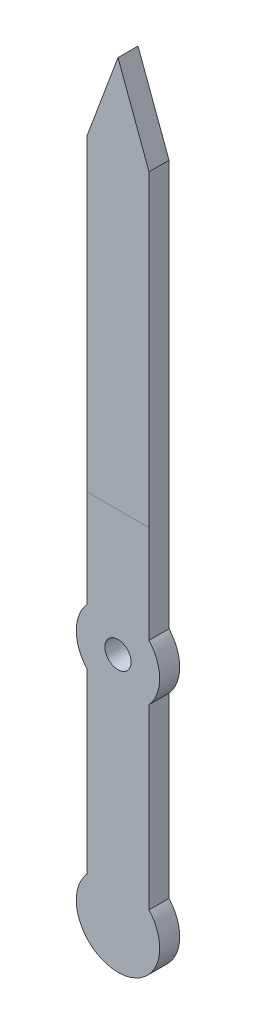
ISO-10303-21;
HEADER;
FILE_DESCRIPTION(('STEP AP214'),'2;1');
FILE_NAME('part.step','',(''),(''),'','','');
FILE_SCHEMA(('AUTOMOTIVE_DESIGN { 1 0 10303 214 1 1 1 1 }'));
ENDSEC;
DATA;
#1=APPLICATION_CONTEXT('core data for automotive mechanical design processes');
#2=APPLICATION_PROTOCOL_DEFINITION('international standard','automotive_design',2000,#1);
#3=PRODUCT_CONTEXT('',#1,'mechanical');
#4=PRODUCT('Part','Part','',(#3));
#5=PRODUCT_RELATED_PRODUCT_CATEGORY('part','',(#4));
#6=PRODUCT_DEFINITION_FORMATION('','',#4);
#7=PRODUCT_DEFINITION_CONTEXT('part definition',#1,'design');
#8=PRODUCT_DEFINITION('design','',#6,#7);
#9=PRODUCT_DEFINITION_SHAPE('','',#8);
#10=(LENGTH_UNIT() NAMED_UNIT(*) SI_UNIT(.MILLI.,.METRE.));
#11=(NAMED_UNIT(*) PLANE_ANGLE_UNIT() SI_UNIT($,.RADIAN.));
#12=(NAMED_UNIT(*) SI_UNIT($,.STERADIAN.) SOLID_ANGLE_UNIT());
#13=UNCERTAINTY_MEASURE_WITH_UNIT(LENGTH_MEASURE(1.E-05),#10,'distance_accuracy_value','');
#14=(GEOMETRIC_REPRESENTATION_CONTEXT(3) GLOBAL_UNCERTAINTY_ASSIGNED_CONTEXT((#13)) GLOBAL_UNIT_ASSIGNED_CONTEXT((#10,
#11,#12)) REPRESENTATION_CONTEXT('',''));
#15=CARTESIAN_POINT('',(0.,0.,0.));
#16=DIRECTION('',(0.,0.,1.));
#17=DIRECTION('',(1.,0.,0.));
#18=AXIS2_PLACEMENT_3D('',#15,#16,#17);
#19=CARTESIAN_POINT('',(0.,0.,0.761999999999995));
#20=DIRECTION('',(0.,0.,0.999999999999998));
#21=DIRECTION('',(1.,0.,0.));
#22=AXIS2_PLACEMENT_3D('',#19,#20,#21);
#23=PLANE('',#22);
#24=CARTESIAN_POINT('',(0.,0.,0.761999999999995));
#25=DIRECTION('',(0.,0.,0.999999999999998));
#26=DIRECTION('',(1.,0.,0.));
#27=AXIS2_PLACEMENT_3D('',#24,#25,#26);
#28=CIRCLE('',#27,0.5);
#29=CARTESIAN_POINT('',(0.500000000000001,0.,0.761999999999995));
#30=VERTEX_POINT('',#29);
#31=EDGE_CURVE('E221',#30,#30,#28,.T.);
#32=ORIENTED_EDGE('',*,*,#31,.F.);
#33=EDGE_LOOP('',(#32));
#34=FACE_BOUND('',#33,.T.);
#35=DIRECTION('',(0.,1.,0.));
#36=VECTOR('',#35,1.);
#37=CARTESIAN_POINT('',(1.1811,1.06073514130531,0.761999999999995));
#38=LINE('',#37,#36);
#39=CARTESIAN_POINT('',(1.1811,1.06073514130531,0.761999999999995));
#40=VERTEX_POINT('',#39);
#41=CARTESIAN_POINT('',(1.1811,4.77520000000002,0.761999999999995));
#42=VERTEX_POINT('',#41);
#43=EDGE_CURVE('E145',#40,#42,#38,.T.);
#44=ORIENTED_EDGE('',*,*,#43,.T.);
#45=DIRECTION('',(-1.,0.,0.));
#46=VECTOR('',#45,1.);
#47=CARTESIAN_POINT('',(0.,4.77520000000001,0.761999999999995));
#48=LINE('',#47,#46);
#49=CARTESIAN_POINT('',(-1.1811,4.77520000000002,0.761999999999995));
#50=VERTEX_POINT('',#49);
#51=EDGE_CURVE('E13',#42,#50,#48,.T.);
#52=ORIENTED_EDGE('',*,*,#51,.T.);
#53=DIRECTION('',(0.,-1.,0.));
#54=VECTOR('',#53,1.);
#55=CARTESIAN_POINT('',(-1.1811,1.06073514130532,0.761999999999995));
#56=LINE('',#55,#54);
#57=CARTESIAN_POINT('',(-1.1811,1.06073514130532,0.761999999999995));
#58=VERTEX_POINT('',#57);
#59=EDGE_CURVE('E236',#50,#58,#56,.T.);
#60=ORIENTED_EDGE('',*,*,#59,.T.);
#61=CARTESIAN_POINT('',(0.,0.,0.761999999999995));
#62=DIRECTION('',(0.,0.,0.999999999999998));
#63=DIRECTION('',(1.,0.,0.));
#64=AXIS2_PLACEMENT_3D('',#61,#62,#63);
#65=CIRCLE('',#64,1.5875);
#66=CARTESIAN_POINT('',(-1.1811,-1.06073514130531,0.761999999999995));
#67=VERTEX_POINT('',#66);
#68=EDGE_CURVE('E230',#58,#67,#65,.T.);
#69=ORIENTED_EDGE('',*,*,#68,.T.);
#70=DIRECTION('',(0.,-1.,0.));
#71=VECTOR('',#70,1.);
#72=CARTESIAN_POINT('',(-1.1811,-1.06073514130531,0.761999999999995));
#73=LINE('',#72,#71);
#74=CARTESIAN_POINT('',(-1.1811,-7.8292648586947,0.761999999999995));
#75=VERTEX_POINT('',#74);
#76=EDGE_CURVE('E227',#67,#75,#73,.T.);
#77=ORIENTED_EDGE('',*,*,#76,.T.);
#78=CARTESIAN_POINT('',(0.,-8.89000000000002,0.761999999999995));
#79=DIRECTION('',(0.,0.,0.999999999999998));
#80=DIRECTION('',(1.,0.,0.));
#81=AXIS2_PLACEMENT_3D('',#78,#79,#80);
#82=CIRCLE('',#81,1.5875);
#83=CARTESIAN_POINT('',(1.1811,-7.8292648586947,0.761999999999995));
#84=VERTEX_POINT('',#83);
#85=EDGE_CURVE('E224',#75,#84,#82,.T.);
#86=ORIENTED_EDGE('',*,*,#85,.T.);
#87=DIRECTION('',(0.,1.,0.));
#88=VECTOR('',#87,1.);
#89=CARTESIAN_POINT('',(1.1811,-1.06073514130531,0.761999999999995));
#90=LINE('',#89,#88);
#91=CARTESIAN_POINT('',(1.1811,-1.06073514130531,0.761999999999995));
#92=VERTEX_POINT('',#91);
#93=EDGE_CURVE('E158',#84,#92,#90,.T.);
#94=ORIENTED_EDGE('',*,*,#93,.T.);
#95=CARTESIAN_POINT('',(0.,0.,0.761999999999995));
#96=DIRECTION('',(0.,0.,0.999999999999998));
#97=DIRECTION('',(1.,0.,0.));
#98=AXIS2_PLACEMENT_3D('',#95,#96,#97);
#99=CIRCLE('',#98,1.5875);
#100=EDGE_CURVE('E156',#92,#40,#99,.T.);
#101=ORIENTED_EDGE('',*,*,#100,.T.);
#102=EDGE_LOOP('',(#44,#52,#60,#69,#77,#86,#94,#101));
#103=FACE_BOUND('',#102,.T.);
#104=ADVANCED_FACE('F57',(#34,#103),#23,.T.);
#105=ORIENTED_EDGE('',*,*,#51,.F.);
#106=CARTESIAN_POINT('',(1.1811,16.51,0.761999999999995));
#107=VERTEX_POINT('',#106);
#108=EDGE_CURVE('E151',#42,#107,#38,.T.);
#109=ORIENTED_EDGE('',*,*,#108,.T.);
#110=DIRECTION('',(-0.348657127931215,0.937250343901117,0.));
#111=VECTOR('',#110,1.);
#112=CARTESIAN_POINT('',(0.,19.685,0.761999999999995));
#113=LINE('',#112,#111);
#114=CARTESIAN_POINT('',(0.,19.685,0.761999999999995));
#115=VERTEX_POINT('',#114);
#116=EDGE_CURVE('E153',#107,#115,#113,.T.);
#117=ORIENTED_EDGE('',*,*,#116,.T.);
#118=DIRECTION('',(-0.348657127931216,-0.937250343901115,0.));
#119=VECTOR('',#118,1.);
#120=CARTESIAN_POINT('',(0.,19.685,0.761999999999995));
#121=LINE('',#120,#119);
#122=CARTESIAN_POINT('',(-1.1811,16.51,0.761999999999995));
#123=VERTEX_POINT('',#122);
#124=EDGE_CURVE('E237',#115,#123,#121,.T.);
#125=ORIENTED_EDGE('',*,*,#124,.T.);
#126=EDGE_CURVE('E233',#123,#50,#56,.T.);
#127=ORIENTED_EDGE('',*,*,#126,.T.);
#128=EDGE_LOOP('',(#105,#109,#117,#125,#127));
#129=FACE_BOUND('',#128,.T.);
#130=ADVANCED_FACE('F251',(#129),#23,.T.);
#131=CARTESIAN_POINT('',(0.,0.,0.));
#132=DIRECTION('',(0.,0.,0.999999999999998));
#133=DIRECTION('',(1.,0.,0.));
#134=AXIS2_PLACEMENT_3D('',#131,#132,#133);
#135=PLANE('',#134);
#136=CARTESIAN_POINT('',(0.,0.,0.));
#137=DIRECTION('',(0.,0.,0.999999999999998));
#138=DIRECTION('',(1.,0.,0.));
#139=AXIS2_PLACEMENT_3D('',#136,#137,#138);
#140=CIRCLE('',#139,1.5875);
#141=CARTESIAN_POINT('',(1.1811,-1.06073514130531,0.));
#142=VERTEX_POINT('',#141);
#143=CARTESIAN_POINT('',(1.1811,1.06073514130531,0.));
#144=VERTEX_POINT('',#143);
#145=EDGE_CURVE('E166',#142,#144,#140,.T.);
#146=ORIENTED_EDGE('',*,*,#145,.F.);
#147=DIRECTION('',(0.,1.,0.));
#148=VECTOR('',#147,1.);
#149=CARTESIAN_POINT('',(1.1811,-1.06073514130531,0.));
#150=LINE('',#149,#148);
#151=CARTESIAN_POINT('',(1.1811,-7.8292648586947,0.));
#152=VERTEX_POINT('',#151);
#153=EDGE_CURVE('E163',#152,#142,#150,.T.);
#154=ORIENTED_EDGE('',*,*,#153,.F.);
#155=CARTESIAN_POINT('',(0.,-8.89000000000002,0.));
#156=DIRECTION('',(0.,0.,0.999999999999998));
#157=DIRECTION('',(1.,0.,0.));
#158=AXIS2_PLACEMENT_3D('',#155,#156,#157);
#159=CIRCLE('',#158,1.5875);
#160=CARTESIAN_POINT('',(-1.1811,-7.8292648586947,0.));
#161=VERTEX_POINT('',#160);
#162=EDGE_CURVE('E200',#161,#152,#159,.T.);
#163=ORIENTED_EDGE('',*,*,#162,.F.);
#164=DIRECTION('',(0.,-1.,0.));
#165=VECTOR('',#164,1.);
#166=CARTESIAN_POINT('',(-1.1811,-1.06073514130531,0.));
#167=LINE('',#166,#165);
#168=CARTESIAN_POINT('',(-1.1811,-1.06073514130531,0.));
#169=VERTEX_POINT('',#168);
#170=EDGE_CURVE('E203',#169,#161,#167,.T.);
#171=ORIENTED_EDGE('',*,*,#170,.F.);
#172=CARTESIAN_POINT('',(0.,0.,0.));
#173=DIRECTION('',(0.,0.,0.999999999999998));
#174=DIRECTION('',(1.,0.,0.));
#175=AXIS2_PLACEMENT_3D('',#172,#173,#174);
#176=CIRCLE('',#175,1.5875);
#177=CARTESIAN_POINT('',(-1.1811,1.06073514130532,0.));
#178=VERTEX_POINT('',#177);
#179=EDGE_CURVE('E206',#178,#169,#176,.T.);
#180=ORIENTED_EDGE('',*,*,#179,.F.);
#181=DIRECTION('',(0.,-1.,0.));
#182=VECTOR('',#181,1.);
#183=CARTESIAN_POINT('',(-1.1811,1.06073514130532,0.));
#184=LINE('',#183,#182);
#185=CARTESIAN_POINT('',(-1.1811,16.51,0.));
#186=VERTEX_POINT('',#185);
#187=EDGE_CURVE('E209',#186,#178,#184,.T.);
#188=ORIENTED_EDGE('',*,*,#187,.F.);
#189=DIRECTION('',(-0.348657127931216,-0.937250343901115,0.));
#190=VECTOR('',#189,1.);
#191=CARTESIAN_POINT('',(0.,19.685,0.));
#192=LINE('',#191,#190);
#193=CARTESIAN_POINT('',(0.,19.685,0.));
#194=VERTEX_POINT('',#193);
#195=EDGE_CURVE('E212',#194,#186,#192,.T.);
#196=ORIENTED_EDGE('',*,*,#195,.F.);
#197=DIRECTION('',(-0.348657127931215,0.937250343901117,0.));
#198=VECTOR('',#197,1.);
#199=CARTESIAN_POINT('',(0.,19.685,0.));
#200=LINE('',#199,#198);
#201=CARTESIAN_POINT('',(1.1811,16.51,0.));
#202=VERTEX_POINT('',#201);
#203=EDGE_CURVE('E214',#202,#194,#200,.T.);
#204=ORIENTED_EDGE('',*,*,#203,.F.);
#205=DIRECTION('',(0.,1.,0.));
#206=VECTOR('',#205,1.);
#207=CARTESIAN_POINT('',(1.1811,1.06073514130531,0.));
#208=LINE('',#207,#206);
#209=EDGE_CURVE('E216',#144,#202,#208,.T.);
#210=ORIENTED_EDGE('',*,*,#209,.F.);
#211=EDGE_LOOP('',(#146,#154,#163,#171,#180,#188,#196,#204,#210));
#212=FACE_BOUND('',#211,.T.);
#213=CARTESIAN_POINT('',(0.,0.,0.));
#214=DIRECTION('',(0.,0.,0.999999999999998));
#215=DIRECTION('',(1.,0.,0.));
#216=AXIS2_PLACEMENT_3D('',#213,#214,#215);
#217=CIRCLE('',#216,0.5);
#218=CARTESIAN_POINT('',(0.500000000000001,0.,0.));
#219=VERTEX_POINT('',#218);
#220=EDGE_CURVE('E240',#219,#219,#217,.T.);
#221=ORIENTED_EDGE('',*,*,#220,.T.);
#222=EDGE_LOOP('',(#221));
#223=FACE_BOUND('',#222,.T.);
#224=ADVANCED_FACE('F256',(#212,#223),#135,.F.);
#225=CARTESIAN_POINT('',(0.,0.,0.761999999999995));
#226=DIRECTION('',(0.,0.,-0.999999999999998));
#227=DIRECTION('',(-1.,0.,0.));
#228=AXIS2_PLACEMENT_3D('',#225,#226,#227);
#229=CYLINDRICAL_SURFACE('',#228,1.5875);
#230=ORIENTED_EDGE('',*,*,#145,.T.);
#231=DIRECTION('',(0.,0.,-0.999999999999998));
#232=VECTOR('',#231,1.);
#233=CARTESIAN_POINT('',(1.1811,1.06073514130531,0.761999999999995));
#234=LINE('',#233,#232);
#235=EDGE_CURVE('E66',#40,#144,#234,.T.);
#236=ORIENTED_EDGE('',*,*,#235,.F.);
#237=ORIENTED_EDGE('',*,*,#100,.F.);
#238=DIRECTION('',(0.,0.,-0.999999999999998));
#239=VECTOR('',#238,1.);
#240=CARTESIAN_POINT('',(1.1811,-1.06073514130531,0.761999999999995));
#241=LINE('',#240,#239);
#242=EDGE_CURVE('E195',#92,#142,#241,.T.);
#243=ORIENTED_EDGE('',*,*,#242,.T.);
#244=EDGE_LOOP('',(#230,#236,#237,#243));
#245=FACE_BOUND('',#244,.T.);
#246=ADVANCED_FACE('F59',(#245),#229,.T.);
#247=CARTESIAN_POINT('',(1.1811,1.06073514130531,0.761999999999995));
#248=DIRECTION('',(-1.,0.,0.));
#249=DIRECTION('',(0.,0.,0.999999999999998));
#250=AXIS2_PLACEMENT_3D('',#247,#248,#249);
#251=PLANE('',#250);
#252=ORIENTED_EDGE('',*,*,#209,.T.);
#253=DIRECTION('',(0.,0.,-0.999999999999998));
#254=VECTOR('',#253,1.);
#255=CARTESIAN_POINT('',(1.1811,16.51,0.761999999999995));
#256=LINE('',#255,#254);
#257=EDGE_CURVE('E168',#107,#202,#256,.T.);
#258=ORIENTED_EDGE('',*,*,#257,.F.);
#259=ORIENTED_EDGE('',*,*,#108,.F.);
#260=ORIENTED_EDGE('',*,*,#43,.F.);
#261=ORIENTED_EDGE('',*,*,#235,.T.);
#262=EDGE_LOOP('',(#252,#258,#259,#260,#261));
#263=FACE_BOUND('',#262,.T.);
#264=ADVANCED_FACE('F147',(#263),#251,.F.);
#265=CARTESIAN_POINT('',(0.,19.685,0.761999999999995));
#266=DIRECTION('',(-0.937250343901117,-0.348657127931215,0.));
#267=DIRECTION('',(0.348657127931215,-0.937250343901117,0.));
#268=AXIS2_PLACEMENT_3D('',#265,#266,#267);
#269=PLANE('',#268);
#270=ORIENTED_EDGE('',*,*,#203,.T.);
#271=DIRECTION('',(0.,0.,-0.999999999999998));
#272=VECTOR('',#271,1.);
#273=CARTESIAN_POINT('',(0.,19.685,0.761999999999995));
#274=LINE('',#273,#272);
#275=EDGE_CURVE('E171',#115,#194,#274,.T.);
#276=ORIENTED_EDGE('',*,*,#275,.F.);
#277=ORIENTED_EDGE('',*,*,#116,.F.);
#278=ORIENTED_EDGE('',*,*,#257,.T.);
#279=EDGE_LOOP('',(#270,#276,#277,#278));
#280=FACE_BOUND('',#279,.T.);
#281=ADVANCED_FACE('F285',(#280),#269,.F.);
#282=CARTESIAN_POINT('',(0.,19.685,0.761999999999995));
#283=DIRECTION('',(0.937250343901115,-0.348657127931216,0.));
#284=DIRECTION('',(0.348657127931216,0.937250343901115,0.));
#285=AXIS2_PLACEMENT_3D('',#282,#283,#284);
#286=PLANE('',#285);
#287=ORIENTED_EDGE('',*,*,#195,.T.);
#288=DIRECTION('',(0.,0.,-0.999999999999998));
#289=VECTOR('',#288,1.);
#290=CARTESIAN_POINT('',(-1.1811,16.51,0.761999999999995));
#291=LINE('',#290,#289);
#292=EDGE_CURVE('E176',#123,#186,#291,.T.);
#293=ORIENTED_EDGE('',*,*,#292,.F.);
#294=ORIENTED_EDGE('',*,*,#124,.F.);
#295=ORIENTED_EDGE('',*,*,#275,.T.);
#296=EDGE_LOOP('',(#287,#293,#294,#295));
#297=FACE_BOUND('',#296,.T.);
#298=ADVANCED_FACE('F281',(#297),#286,.F.);
#299=CARTESIAN_POINT('',(-1.1811,1.06073514130532,0.761999999999995));
#300=DIRECTION('',(1.,0.,0.));
#301=DIRECTION('',(0.,0.,-0.999999999999998));
#302=AXIS2_PLACEMENT_3D('',#299,#300,#301);
#303=PLANE('',#302);
#304=ORIENTED_EDGE('',*,*,#187,.T.);
#305=DIRECTION('',(0.,0.,-0.999999999999998));
#306=VECTOR('',#305,1.);
#307=CARTESIAN_POINT('',(-1.1811,1.06073514130532,0.761999999999995));
#308=LINE('',#307,#306);
#309=EDGE_CURVE('E179',#58,#178,#308,.T.);
#310=ORIENTED_EDGE('',*,*,#309,.F.);
#311=ORIENTED_EDGE('',*,*,#59,.F.);
#312=ORIENTED_EDGE('',*,*,#126,.F.);
#313=ORIENTED_EDGE('',*,*,#292,.T.);
#314=EDGE_LOOP('',(#304,#310,#311,#312,#313));
#315=FACE_BOUND('',#314,.T.);
#316=ADVANCED_FACE('F277',(#315),#303,.F.);
#317=CARTESIAN_POINT('',(0.,0.,0.761999999999995));
#318=DIRECTION('',(0.,0.,-0.999999999999998));
#319=DIRECTION('',(-1.,0.,0.));
#320=AXIS2_PLACEMENT_3D('',#317,#318,#319);
#321=CYLINDRICAL_SURFACE('',#320,1.5875);
#322=ORIENTED_EDGE('',*,*,#179,.T.);
#323=DIRECTION('',(0.,0.,-0.999999999999998));
#324=VECTOR('',#323,1.);
#325=CARTESIAN_POINT('',(-1.1811,-1.06073514130531,0.761999999999995));
#326=LINE('',#325,#324);
#327=EDGE_CURVE('E183',#67,#169,#326,.T.);
#328=ORIENTED_EDGE('',*,*,#327,.F.);
#329=ORIENTED_EDGE('',*,*,#68,.F.);
#330=ORIENTED_EDGE('',*,*,#309,.T.);
#331=EDGE_LOOP('',(#322,#328,#329,#330));
#332=FACE_BOUND('',#331,.T.);
#333=ADVANCED_FACE('F273',(#332),#321,.T.);
#334=CARTESIAN_POINT('',(-1.1811,-1.06073514130531,0.761999999999995));
#335=DIRECTION('',(1.,0.,0.));
#336=DIRECTION('',(0.,0.,-0.999999999999998));
#337=AXIS2_PLACEMENT_3D('',#334,#335,#336);
#338=PLANE('',#337);
#339=ORIENTED_EDGE('',*,*,#170,.T.);
#340=DIRECTION('',(0.,0.,-0.999999999999998));
#341=VECTOR('',#340,1.);
#342=CARTESIAN_POINT('',(-1.1811,-7.8292648586947,0.761999999999995));
#343=LINE('',#342,#341);
#344=EDGE_CURVE('E187',#75,#161,#343,.T.);
#345=ORIENTED_EDGE('',*,*,#344,.F.);
#346=ORIENTED_EDGE('',*,*,#76,.F.);
#347=ORIENTED_EDGE('',*,*,#327,.T.);
#348=EDGE_LOOP('',(#339,#345,#346,#347));
#349=FACE_BOUND('',#348,.T.);
#350=ADVANCED_FACE('F269',(#349),#338,.F.);
#351=CARTESIAN_POINT('',(0.,-8.89000000000002,0.761999999999995));
#352=DIRECTION('',(0.,0.,-0.999999999999998));
#353=DIRECTION('',(-1.,0.,0.));
#354=AXIS2_PLACEMENT_3D('',#351,#352,#353);
#355=CYLINDRICAL_SURFACE('',#354,1.5875);
#356=ORIENTED_EDGE('',*,*,#162,.T.);
#357=DIRECTION('',(0.,0.,-0.999999999999998));
#358=VECTOR('',#357,1.);
#359=CARTESIAN_POINT('',(1.1811,-7.8292648586947,0.761999999999995));
#360=LINE('',#359,#358);
#361=EDGE_CURVE('E191',#84,#152,#360,.T.);
#362=ORIENTED_EDGE('',*,*,#361,.F.);
#363=ORIENTED_EDGE('',*,*,#85,.F.);
#364=ORIENTED_EDGE('',*,*,#344,.T.);
#365=EDGE_LOOP('',(#356,#362,#363,#364));
#366=FACE_BOUND('',#365,.T.);
#367=ADVANCED_FACE('F265',(#366),#355,.T.);
#368=CARTESIAN_POINT('',(1.1811,-1.06073514130531,0.761999999999995));
#369=DIRECTION('',(-1.,0.,0.));
#370=DIRECTION('',(0.,0.,0.999999999999998));
#371=AXIS2_PLACEMENT_3D('',#368,#369,#370);
#372=PLANE('',#371);
#373=ORIENTED_EDGE('',*,*,#153,.T.);
#374=ORIENTED_EDGE('',*,*,#242,.F.);
#375=ORIENTED_EDGE('',*,*,#93,.F.);
#376=ORIENTED_EDGE('',*,*,#361,.T.);
#377=EDGE_LOOP('',(#373,#374,#375,#376));
#378=FACE_BOUND('',#377,.T.);
#379=ADVANCED_FACE('F262',(#378),#372,.F.);
#380=CARTESIAN_POINT('',(0.,0.,0.761999999999995));
#381=DIRECTION('',(0.,0.,-0.999999999999998));
#382=DIRECTION('',(-1.,0.,0.));
#383=AXIS2_PLACEMENT_3D('',#380,#381,#382);
#384=CYLINDRICAL_SURFACE('',#383,0.5);
#385=ORIENTED_EDGE('',*,*,#31,.T.);
#386=EDGE_LOOP('',(#385));
#387=FACE_BOUND('',#386,.T.);
#388=ORIENTED_EDGE('',*,*,#220,.F.);
#389=EDGE_LOOP('',(#388));
#390=FACE_BOUND('',#389,.T.);
#391=ADVANCED_FACE('F247',(#387,#390),#384,.F.);
#392=CLOSED_SHELL('',(#104,#130,#224,#246,#264,#281,#298,#316,#333,#350,#367,#379,#391));
#393=MANIFOLD_SOLID_BREP('B2',#392);
#394=ADVANCED_BREP_SHAPE_REPRESENTATION('',(#18,#393),#14);
#395=SHAPE_DEFINITION_REPRESENTATION(#9,#394);
ENDSEC;
END-ISO-10303-21;
